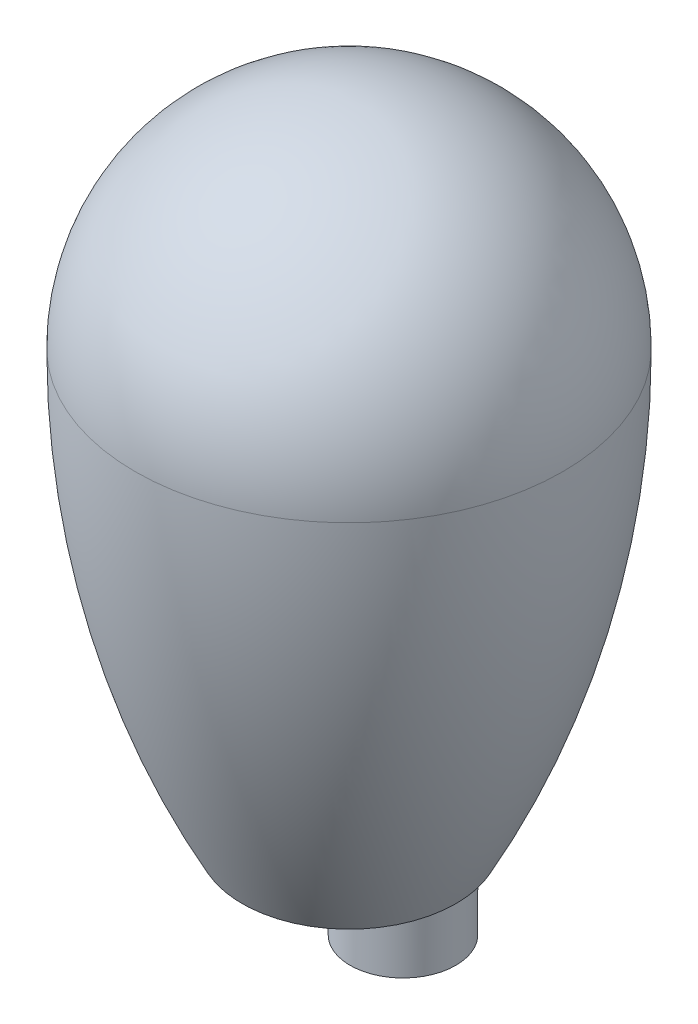
ISO-10303-21;
HEADER;
FILE_DESCRIPTION(('STEP AP214'),'2;1');
FILE_NAME('part.step','',(''),(''),'','','');
FILE_SCHEMA(('AUTOMOTIVE_DESIGN { 1 0 10303 214 1 1 1 1 }'));
ENDSEC;
DATA;
#1=APPLICATION_CONTEXT('core data for automotive mechanical design processes');
#2=APPLICATION_PROTOCOL_DEFINITION('international standard','automotive_design',2000,#1);
#3=PRODUCT_CONTEXT('',#1,'mechanical');
#4=PRODUCT('Part','Part','',(#3));
#5=PRODUCT_RELATED_PRODUCT_CATEGORY('part','',(#4));
#6=PRODUCT_DEFINITION_FORMATION('','',#4);
#7=PRODUCT_DEFINITION_CONTEXT('part definition',#1,'design');
#8=PRODUCT_DEFINITION('design','',#6,#7);
#9=PRODUCT_DEFINITION_SHAPE('','',#8);
#10=(LENGTH_UNIT() NAMED_UNIT(*) SI_UNIT(.MILLI.,.METRE.));
#11=(NAMED_UNIT(*) PLANE_ANGLE_UNIT() SI_UNIT($,.RADIAN.));
#12=(NAMED_UNIT(*) SI_UNIT($,.STERADIAN.) SOLID_ANGLE_UNIT());
#13=UNCERTAINTY_MEASURE_WITH_UNIT(LENGTH_MEASURE(1.E-05),#10,'distance_accuracy_value','');
#14=(GEOMETRIC_REPRESENTATION_CONTEXT(3) GLOBAL_UNCERTAINTY_ASSIGNED_CONTEXT((#13)) GLOBAL_UNIT_ASSIGNED_CONTEXT((#10,
#11,#12)) REPRESENTATION_CONTEXT('',''));
#15=CARTESIAN_POINT('',(0.,0.,0.));
#16=DIRECTION('',(0.,0.,1.));
#17=DIRECTION('',(1.,0.,0.));
#18=AXIS2_PLACEMENT_3D('',#15,#16,#17);
#19=CARTESIAN_POINT('',(0.,0.,0.));
#20=DIRECTION('',(0.,-1.,0.));
#21=DIRECTION('',(0.,0.,-1.));
#22=AXIS2_PLACEMENT_3D('',#19,#20,#21);
#23=PLANE('',#22);
#24=CARTESIAN_POINT('',(0.,0.,0.));
#25=DIRECTION('',(0.,-1.,0.));
#26=DIRECTION('',(0.,0.,-1.));
#27=AXIS2_PLACEMENT_3D('',#24,#25,#26);
#28=CIRCLE('',#27,0.500000000000001);
#29=CARTESIAN_POINT('',(0.500000000000001,0.,0.));
#30=VERTEX_POINT('',#29);
#31=CARTESIAN_POINT('',(-0.500000000000001,0.,0.));
#32=VERTEX_POINT('',#31);
#33=EDGE_CURVE('E40',#30,#32,#28,.T.);
#34=ORIENTED_EDGE('',*,*,#33,.T.);
#35=CARTESIAN_POINT('',(-0.252500000000001,0.,0.));
#36=DIRECTION('',(0.,-1.,0.));
#37=DIRECTION('',(0.,0.,-1.));
#38=AXIS2_PLACEMENT_3D('',#35,#36,#37);
#39=CIRCLE('',#38,0.2475);
#40=EDGE_CURVE('E45',#32,#32,#39,.T.);
#41=ORIENTED_EDGE('',*,*,#40,.F.);
#42=EDGE_CURVE('E50',#32,#30,#28,.T.);
#43=ORIENTED_EDGE('',*,*,#42,.T.);
#44=CARTESIAN_POINT('',(0.252500000000001,0.,0.));
#45=DIRECTION('',(0.,-1.,0.));
#46=DIRECTION('',(0.,0.,-1.));
#47=AXIS2_PLACEMENT_3D('',#44,#45,#46);
#48=CIRCLE('',#47,0.2475);
#49=EDGE_CURVE('E54',#30,#30,#48,.T.);
#50=ORIENTED_EDGE('',*,*,#49,.F.);
#51=EDGE_LOOP('',(#34,#41,#43,#50));
#52=FACE_BOUND('',#51,.T.);
#53=ADVANCED_FACE('F32',(#52),#23,.T.);
#54=CARTESIAN_POINT('',(0.,2.,0.));
#55=DIRECTION('',(0.,-1.,0.));
#56=DIRECTION('',(1.,0.,0.));
#57=AXIS2_PLACEMENT_3D('',#54,#55,#56);
#58=SPHERICAL_SURFACE('',#57,1.);
#59=CARTESIAN_POINT('',(0.,2.,0.));
#60=DIRECTION('',(0.,-1.,0.));
#61=DIRECTION('',(0.,0.,-1.));
#62=AXIS2_PLACEMENT_3D('',#59,#60,#61);
#63=CIRCLE('',#62,1.);
#64=CARTESIAN_POINT('',(0.,2.,-1.));
#65=VERTEX_POINT('',#64);
#66=EDGE_CURVE('E11',#65,#65,#63,.T.);
#67=ORIENTED_EDGE('',*,*,#66,.F.);
#68=EDGE_LOOP('',(#67));
#69=FACE_BOUND('',#68,.T.);
#70=ADVANCED_FACE('F34',(#69),#58,.T.);
#71=CARTESIAN_POINT('',(0.,2.,0.));
#72=DIRECTION('',(0.,-1.,0.));
#73=DIRECTION('',(0.,0.,-1.));
#74=AXIS2_PLACEMENT_3D('',#71,#72,#73);
#75=DEGENERATE_TOROIDAL_SURFACE('',#74,3.25,4.25,.F.);
#76=ORIENTED_EDGE('',*,*,#66,.T.);
#77=EDGE_LOOP('',(#76));
#78=FACE_BOUND('',#77,.T.);
#79=ORIENTED_EDGE('',*,*,#33,.F.);
#80=ORIENTED_EDGE('',*,*,#42,.F.);
#81=EDGE_LOOP('',(#79,#80));
#82=FACE_BOUND('',#81,.T.);
#83=ADVANCED_FACE('F57',(#78,#82),#75,.F.);
#84=CARTESIAN_POINT('',(0.252500000000001,-0.25,0.));
#85=DIRECTION('',(0.,1.,0.));
#86=DIRECTION('',(0.,0.,1.));
#87=AXIS2_PLACEMENT_3D('',#84,#85,#86);
#88=CYLINDRICAL_SURFACE('',#87,0.2475);
#89=CARTESIAN_POINT('',(0.252500000000001,-0.25,0.));
#90=DIRECTION('',(0.,-1.,0.));
#91=DIRECTION('',(0.,0.,-1.));
#92=AXIS2_PLACEMENT_3D('',#89,#90,#91);
#93=CIRCLE('',#92,0.2475);
#94=CARTESIAN_POINT('',(0.252500000000001,-0.25,-0.2475));
#95=VERTEX_POINT('',#94);
#96=EDGE_CURVE('E56',#95,#95,#93,.T.);
#97=ORIENTED_EDGE('',*,*,#96,.F.);
#98=EDGE_LOOP('',(#97));
#99=FACE_BOUND('',#98,.T.);
#100=ORIENTED_EDGE('',*,*,#49,.T.);
#101=EDGE_LOOP('',(#100));
#102=FACE_BOUND('',#101,.T.);
#103=ADVANCED_FACE('F78',(#99,#102),#88,.T.);
#104=CARTESIAN_POINT('',(0.252500000000001,-0.25,0.));
#105=DIRECTION('',(0.,-1.,0.));
#106=DIRECTION('',(0.,0.,-1.));
#107=AXIS2_PLACEMENT_3D('',#104,#105,#106);
#108=PLANE('',#107);
#109=ORIENTED_EDGE('',*,*,#96,.T.);
#110=EDGE_LOOP('',(#109));
#111=FACE_BOUND('',#110,.T.);
#112=ADVANCED_FACE('F71',(#111),#108,.T.);
#113=CARTESIAN_POINT('',(-0.252500000000001,-0.25,0.));
#114=DIRECTION('',(0.,1.,0.));
#115=DIRECTION('',(0.,0.,1.));
#116=AXIS2_PLACEMENT_3D('',#113,#114,#115);
#117=CYLINDRICAL_SURFACE('',#116,0.2475);
#118=CARTESIAN_POINT('',(-0.252500000000001,-0.25,0.));
#119=DIRECTION('',(0.,-1.,0.));
#120=DIRECTION('',(0.,0.,-1.));
#121=AXIS2_PLACEMENT_3D('',#118,#119,#120);
#122=CIRCLE('',#121,0.2475);
#123=CARTESIAN_POINT('',(-0.252500000000001,-0.25,-0.2475));
#124=VERTEX_POINT('',#123);
#125=EDGE_CURVE('E60',#124,#124,#122,.T.);
#126=ORIENTED_EDGE('',*,*,#125,.F.);
#127=EDGE_LOOP('',(#126));
#128=FACE_BOUND('',#127,.T.);
#129=ORIENTED_EDGE('',*,*,#40,.T.);
#130=EDGE_LOOP('',(#129));
#131=FACE_BOUND('',#130,.T.);
#132=ADVANCED_FACE('F69',(#128,#131),#117,.T.);
#133=CARTESIAN_POINT('',(-0.252500000000001,-0.25,0.));
#134=DIRECTION('',(0.,-1.,0.));
#135=DIRECTION('',(0.,0.,-1.));
#136=AXIS2_PLACEMENT_3D('',#133,#134,#135);
#137=PLANE('',#136);
#138=ORIENTED_EDGE('',*,*,#125,.T.);
#139=EDGE_LOOP('',(#138));
#140=FACE_BOUND('',#139,.T.);
#141=ADVANCED_FACE('F67',(#140),#137,.T.);
#142=CLOSED_SHELL('',(#53,#70,#83,#103,#112,#132,#141));
#143=MANIFOLD_SOLID_BREP('B2',#142);
#144=ADVANCED_BREP_SHAPE_REPRESENTATION('',(#18,#143),#14);
#145=SHAPE_DEFINITION_REPRESENTATION(#9,#144);
ENDSEC;
END-ISO-10303-21;
